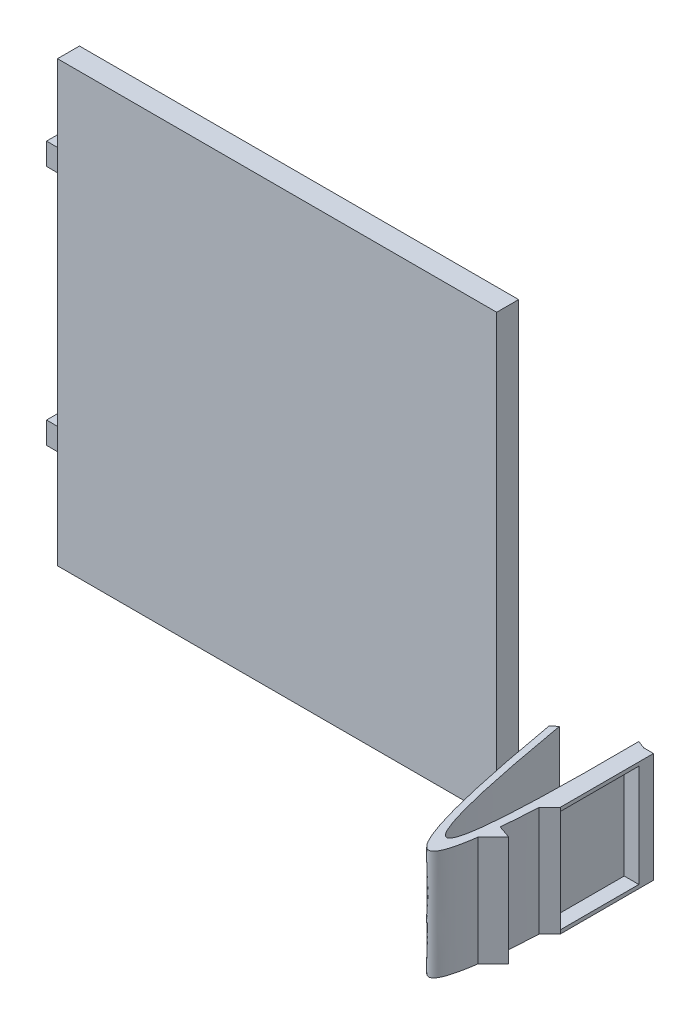
ISO-10303-21;
HEADER;
FILE_DESCRIPTION(('STEP AP214'),'2;1');
FILE_NAME('part.step','',(''),(''),'','','');
FILE_SCHEMA(('AUTOMOTIVE_DESIGN { 1 0 10303 214 1 1 1 1 }'));
ENDSEC;
DATA;
#1=APPLICATION_CONTEXT('core data for automotive mechanical design processes');
#2=APPLICATION_PROTOCOL_DEFINITION('international standard','automotive_design',2000,#1);
#3=PRODUCT_CONTEXT('',#1,'mechanical');
#4=PRODUCT('Part','Part','',(#3));
#5=PRODUCT_RELATED_PRODUCT_CATEGORY('part','',(#4));
#6=PRODUCT_DEFINITION_FORMATION('','',#4);
#7=PRODUCT_DEFINITION_CONTEXT('part definition',#1,'design');
#8=PRODUCT_DEFINITION('design','',#6,#7);
#9=PRODUCT_DEFINITION_SHAPE('','',#8);
#10=(LENGTH_UNIT() NAMED_UNIT(*) SI_UNIT(.MILLI.,.METRE.));
#11=(NAMED_UNIT(*) PLANE_ANGLE_UNIT() SI_UNIT($,.RADIAN.));
#12=(NAMED_UNIT(*) SI_UNIT($,.STERADIAN.) SOLID_ANGLE_UNIT());
#13=UNCERTAINTY_MEASURE_WITH_UNIT(LENGTH_MEASURE(1.E-05),#10,'distance_accuracy_value','');
#14=(GEOMETRIC_REPRESENTATION_CONTEXT(3) GLOBAL_UNCERTAINTY_ASSIGNED_CONTEXT((#13)) GLOBAL_UNIT_ASSIGNED_CONTEXT((#10,
#11,#12)) REPRESENTATION_CONTEXT('',''));
#15=CARTESIAN_POINT('',(0.,0.,0.));
#16=DIRECTION('',(0.,0.,1.));
#17=DIRECTION('',(1.,0.,0.));
#18=AXIS2_PLACEMENT_3D('',#15,#16,#17);
#19=CARTESIAN_POINT('',(-51.1962754260367,15.,5.77887922105447));
#20=CARTESIAN_POINT('',(-43.6159719352513,15.,49.1829599990755));
#21=CARTESIAN_POINT('',(-43.9884191852826,15.,2.12821551107821));
#22=B_SPLINE_CURVE_WITH_KNOTS('',2,(#19,#20,#21),.UNSPECIFIED.,.F.,.F.,(3,3),(0.,1.),.UNSPECIFIED.);
#23=DIRECTION('',(0.,-1.,0.));
#24=VECTOR('',#23,1.);
#25=SURFACE_OF_LINEAR_EXTRUSION('',#22,#24);
#26=CARTESIAN_POINT('',(-51.1962754260367,0.,5.77887922105447));
#27=CARTESIAN_POINT('',(-43.6159719352513,0.,49.1829599990755));
#28=CARTESIAN_POINT('',(-43.9884191852826,0.,2.12821551107821));
#29=B_SPLINE_CURVE_WITH_KNOTS('',2,(#26,#27,#28),.UNSPECIFIED.,.F.,.F.,(3,3),(0.,1.),.UNSPECIFIED.);
#30=CARTESIAN_POINT('',(-51.1962754260367,0.,5.77887922105447));
#31=VERTEX_POINT('',#30);
#32=CARTESIAN_POINT('',(-43.9884191852826,0.,2.12821551107823));
#33=VERTEX_POINT('',#32);
#34=EDGE_CURVE('E164',#31,#33,#29,.T.);
#35=ORIENTED_EDGE('',*,*,#34,.F.);
#36=DIRECTION('',(0.,-1.,0.));
#37=VECTOR('',#36,1.);
#38=CARTESIAN_POINT('',(-51.1962754260367,15.,5.77887922105447));
#39=LINE('',#38,#37);
#40=CARTESIAN_POINT('',(-51.1962754260367,15.,5.77887922105447));
#41=VERTEX_POINT('',#40);
#42=EDGE_CURVE('E12',#41,#31,#39,.T.);
#43=ORIENTED_EDGE('',*,*,#42,.F.);
#44=CARTESIAN_POINT('',(-43.9884191852826,15.,2.12821551107823));
#45=VERTEX_POINT('',#44);
#46=EDGE_CURVE('E196',#41,#45,#22,.T.);
#47=ORIENTED_EDGE('',*,*,#46,.T.);
#48=DIRECTION('',(0.,-1.,0.));
#49=VECTOR('',#48,1.);
#50=CARTESIAN_POINT('',(-43.9884191852826,15.,2.12821551107823));
#51=LINE('',#50,#49);
#52=EDGE_CURVE('E69',#45,#33,#51,.T.);
#53=ORIENTED_EDGE('',*,*,#52,.T.);
#54=EDGE_LOOP('',(#35,#43,#47,#53));
#55=FACE_BOUND('',#54,.T.);
#56=ADVANCED_FACE('F45',(#55),#25,.T.);
#57=CARTESIAN_POINT('',(-16.2333755961962,15.,-21.1087842015149));
#58=DIRECTION('',(-0.609612829217716,0.,-0.792699311500377));
#59=DIRECTION('',(-0.792699311500377,0.,0.609612829217716));
#60=AXIS2_PLACEMENT_3D('',#57,#58,#59);
#61=PLANE('',#60);
#62=DIRECTION('',(0.792699311500377,0.,-0.609612829217716));
#63=VECTOR('',#62,1.);
#64=CARTESIAN_POINT('',(-16.2333755961962,0.,-21.1087842015149));
#65=LINE('',#64,#63);
#66=CARTESIAN_POINT('',(-51.9660766051118,0.,6.37088260481278));
#67=VERTEX_POINT('',#66);
#68=EDGE_CURVE('E168',#67,#31,#65,.T.);
#69=ORIENTED_EDGE('',*,*,#68,.F.);
#70=DIRECTION('',(0.,-1.,0.));
#71=VECTOR('',#70,1.);
#72=CARTESIAN_POINT('',(-51.9660766051118,15.,6.37088260481278));
#73=LINE('',#72,#71);
#74=CARTESIAN_POINT('',(-51.9660766051118,15.,6.37088260481278));
#75=VERTEX_POINT('',#74);
#76=EDGE_CURVE('E53',#75,#67,#73,.T.);
#77=ORIENTED_EDGE('',*,*,#76,.F.);
#78=DIRECTION('',(0.792699311500377,0.,-0.609612829217716));
#79=VECTOR('',#78,1.);
#80=CARTESIAN_POINT('',(-16.2333755961962,15.,-21.1087842015149));
#81=LINE('',#80,#79);
#82=EDGE_CURVE('E227',#75,#41,#81,.T.);
#83=ORIENTED_EDGE('',*,*,#82,.T.);
#84=ORIENTED_EDGE('',*,*,#42,.T.);
#85=EDGE_LOOP('',(#69,#77,#83,#84));
#86=FACE_BOUND('',#85,.T.);
#87=ADVANCED_FACE('F226',(#86),#61,.T.);
#88=CARTESIAN_POINT('',(-51.9660766051118,15.,6.37088260481278));
#89=CARTESIAN_POINT('',(-43.9063655122837,15.,52.160925824761));
#90=CARTESIAN_POINT('',(-42.4311206277044,15.,17.9235905296126));
#91=CARTESIAN_POINT('',(-42.8930388904973,15.,2.5378638465412));
#92=B_SPLINE_CURVE_WITH_KNOTS('',3,(#88,#89,#90,#91),.UNSPECIFIED.,.F.,.F.,(4,4),(0.,1.),.UNSPECIFIED.);
#93=DIRECTION('',(0.,-1.,0.));
#94=VECTOR('',#93,1.);
#95=SURFACE_OF_LINEAR_EXTRUSION('',#92,#94);
#96=CARTESIAN_POINT('',(-51.9660766051118,0.,6.37088260481278));
#97=CARTESIAN_POINT('',(-43.9063655122837,0.,52.160925824761));
#98=CARTESIAN_POINT('',(-42.4311206277044,0.,17.9235905296126));
#99=CARTESIAN_POINT('',(-42.8930388904973,0.,2.5378638465412));
#100=B_SPLINE_CURVE_WITH_KNOTS('',3,(#96,#97,#98,#99),.UNSPECIFIED.,.F.,.F.,(4,4),(0.,1.),.UNSPECIFIED.);
#101=CARTESIAN_POINT('',(-43.6555720347852,0.,24.3988873492868));
#102=VERTEX_POINT('',#101);
#103=EDGE_CURVE('E175',#67,#102,#100,.T.);
#104=ORIENTED_EDGE('',*,*,#103,.T.);
#105=DIRECTION('',(0.,-1.,0.));
#106=VECTOR('',#105,1.);
#107=CARTESIAN_POINT('',(-43.6555720347852,15.,24.3988873492868));
#108=LINE('',#107,#106);
#109=CARTESIAN_POINT('',(-43.6555720347852,15.,24.3988873492868));
#110=VERTEX_POINT('',#109);
#111=EDGE_CURVE('E210',#110,#102,#108,.T.);
#112=ORIENTED_EDGE('',*,*,#111,.F.);
#113=EDGE_CURVE('E217',#75,#110,#92,.T.);
#114=ORIENTED_EDGE('',*,*,#113,.F.);
#115=ORIENTED_EDGE('',*,*,#76,.T.);
#116=EDGE_LOOP('',(#104,#112,#114,#115));
#117=FACE_BOUND('',#116,.T.);
#118=ADVANCED_FACE('F215',(#117),#95,.F.);
#119=CARTESIAN_POINT('',(-9.6283423427493,15.,-9.62834234274927));
#120=DIRECTION('',(-0.707106781186549,0.,-0.707106781186546));
#121=DIRECTION('',(-0.707106781186546,0.,0.707106781186549));
#122=AXIS2_PLACEMENT_3D('',#119,#120,#121);
#123=PLANE('',#122);
#124=DIRECTION('',(0.707106781186546,0.,-0.707106781186549));
#125=VECTOR('',#124,1.);
#126=CARTESIAN_POINT('',(-9.6283423427493,0.,-9.62834234274927));
#127=LINE('',#126,#125);
#128=CARTESIAN_POINT('',(-41.5703826815086,0.,22.3136979960101));
#129=VERTEX_POINT('',#128);
#130=EDGE_CURVE('E179',#102,#129,#127,.T.);
#131=ORIENTED_EDGE('',*,*,#130,.T.);
#132=DIRECTION('',(0.,-1.,0.));
#133=VECTOR('',#132,1.);
#134=CARTESIAN_POINT('',(-41.5703826815086,15.,22.3136979960101));
#135=LINE('',#134,#133);
#136=CARTESIAN_POINT('',(-41.5703826815086,15.,22.3136979960101));
#137=VERTEX_POINT('',#136);
#138=EDGE_CURVE('E207',#137,#129,#135,.T.);
#139=ORIENTED_EDGE('',*,*,#138,.F.);
#140=DIRECTION('',(0.707106781186546,0.,-0.707106781186549));
#141=VECTOR('',#140,1.);
#142=CARTESIAN_POINT('',(-9.6283423427493,15.,-9.62834234274927));
#143=LINE('',#142,#141);
#144=EDGE_CURVE('E248',#110,#137,#143,.T.);
#145=ORIENTED_EDGE('',*,*,#144,.F.);
#146=ORIENTED_EDGE('',*,*,#111,.T.);
#147=EDGE_LOOP('',(#131,#139,#145,#146));
#148=FACE_BOUND('',#147,.T.);
#149=ADVANCED_FACE('F247',(#148),#123,.F.);
#150=CARTESIAN_POINT('',(-11.293352944187,15.,32.753248292552));
#151=DIRECTION('',(-0.325968224772218,0.,0.945380725654405));
#152=DIRECTION('',(0.945380725654405,0.,0.325968224772218));
#153=AXIS2_PLACEMENT_3D('',#150,#151,#152);
#154=PLANE('',#153);
#155=DIRECTION('',(-0.945380725654405,0.,-0.325968224772218));
#156=VECTOR('',#155,1.);
#157=CARTESIAN_POINT('',(-11.293352944187,0.,32.753248292552));
#158=LINE('',#157,#156);
#159=CARTESIAN_POINT('',(-43.3481908012841,0.,21.7007079687507));
#160=VERTEX_POINT('',#159);
#161=EDGE_CURVE('E185',#129,#160,#158,.T.);
#162=ORIENTED_EDGE('',*,*,#161,.T.);
#163=DIRECTION('',(0.,-1.,0.));
#164=VECTOR('',#163,1.);
#165=CARTESIAN_POINT('',(-43.3481908012841,15.,21.7007079687507));
#166=LINE('',#165,#164);
#167=CARTESIAN_POINT('',(-43.3481908012841,15.,21.7007079687507));
#168=VERTEX_POINT('',#167);
#169=EDGE_CURVE('E204',#168,#160,#166,.T.);
#170=ORIENTED_EDGE('',*,*,#169,.F.);
#171=DIRECTION('',(-0.945380725654405,0.,-0.325968224772218));
#172=VECTOR('',#171,1.);
#173=CARTESIAN_POINT('',(-11.293352944187,15.,32.753248292552));
#174=LINE('',#173,#172);
#175=EDGE_CURVE('E243',#137,#168,#174,.T.);
#176=ORIENTED_EDGE('',*,*,#175,.F.);
#177=ORIENTED_EDGE('',*,*,#138,.T.);
#178=EDGE_LOOP('',(#162,#170,#176,#177));
#179=FACE_BOUND('',#178,.T.);
#180=ADVANCED_FACE('F242',(#179),#154,.F.);
#181=CARTESIAN_POINT('',(-43.011516668746,0.,16.7145404644495));
#182=VERTEX_POINT('',#181);
#183=EDGE_CURVE('E180',#160,#182,#100,.T.);
#184=ORIENTED_EDGE('',*,*,#183,.T.);
#185=DIRECTION('',(0.,-1.,0.));
#186=VECTOR('',#185,1.);
#187=CARTESIAN_POINT('',(-43.011516668746,15.,16.7145404644495));
#188=LINE('',#187,#186);
#189=CARTESIAN_POINT('',(-43.011516668746,15.,16.7145404644495));
#190=VERTEX_POINT('',#189);
#191=EDGE_CURVE('E201',#190,#182,#188,.T.);
#192=ORIENTED_EDGE('',*,*,#191,.F.);
#193=EDGE_CURVE('E238',#168,#190,#92,.T.);
#194=ORIENTED_EDGE('',*,*,#193,.F.);
#195=ORIENTED_EDGE('',*,*,#169,.T.);
#196=EDGE_LOOP('',(#184,#192,#194,#195));
#197=FACE_BOUND('',#196,.T.);
#198=ADVANCED_FACE('F237',(#197),#95,.F.);
#199=CARTESIAN_POINT('',(-13.1484881021466,15.,-13.1484881021466));
#200=DIRECTION('',(-0.707106781186549,0.,-0.707106781186546));
#201=DIRECTION('',(-0.707106781186546,0.,0.707106781186549));
#202=AXIS2_PLACEMENT_3D('',#199,#200,#201);
#203=PLANE('',#202);
#204=DIRECTION('',(0.707106781186546,0.,-0.707106781186549));
#205=VECTOR('',#204,1.);
#206=CARTESIAN_POINT('',(-13.1484881021466,0.,-13.1484881021466));
#207=LINE('',#206,#205);
#208=CARTESIAN_POINT('',(-41.5703826815086,0.,15.2734064772156));
#209=VERTEX_POINT('',#208);
#210=EDGE_CURVE('E187',#182,#209,#207,.T.);
#211=ORIENTED_EDGE('',*,*,#210,.T.);
#212=DIRECTION('',(0.,-1.,0.));
#213=VECTOR('',#212,1.);
#214=CARTESIAN_POINT('',(-41.5703826815086,15.,15.2734064772156));
#215=LINE('',#214,#213);
#216=CARTESIAN_POINT('',(-41.5703826815086,0.5,15.2734064772156));
#217=VERTEX_POINT('',#216);
#218=EDGE_CURVE('E155',#217,#209,#215,.T.);
#219=ORIENTED_EDGE('',*,*,#218,.F.);
#220=DIRECTION('',(0.,-1.,0.));
#221=VECTOR('',#220,1.);
#222=CARTESIAN_POINT('',(-41.5703826815086,0.5,15.2734064772156));
#223=LINE('',#222,#221);
#224=CARTESIAN_POINT('',(-41.5703826815086,14.5,15.2734064772156));
#225=VERTEX_POINT('',#224);
#226=EDGE_CURVE('E60',#225,#217,#223,.T.);
#227=ORIENTED_EDGE('',*,*,#226,.F.);
#228=CARTESIAN_POINT('',(-41.5703826815086,15.,15.2734064772156));
#229=VERTEX_POINT('',#228);
#230=EDGE_CURVE('E199',#229,#225,#215,.T.);
#231=ORIENTED_EDGE('',*,*,#230,.F.);
#232=DIRECTION('',(0.707106781186546,0.,-0.707106781186549));
#233=VECTOR('',#232,1.);
#234=CARTESIAN_POINT('',(-13.1484881021466,15.,-13.1484881021466));
#235=LINE('',#234,#233);
#236=EDGE_CURVE('E142',#190,#229,#235,.T.);
#237=ORIENTED_EDGE('',*,*,#236,.F.);
#238=ORIENTED_EDGE('',*,*,#191,.T.);
#239=EDGE_LOOP('',(#211,#219,#227,#231,#237,#238));
#240=FACE_BOUND('',#239,.T.);
#241=ADVANCED_FACE('F233',(#240),#203,.F.);
#242=CARTESIAN_POINT('',(-41.5703826815086,15.,0.));
#243=DIRECTION('',(-1.,0.,0.));
#244=DIRECTION('',(0.,0.,1.));
#245=AXIS2_PLACEMENT_3D('',#242,#243,#244);
#246=PLANE('',#245);
#247=ORIENTED_EDGE('',*,*,#230,.T.);
#248=DIRECTION('',(0.,0.,1.));
#249=VECTOR('',#248,1.);
#250=CARTESIAN_POINT('',(-41.5703826815086,14.5,15.2734064772156));
#251=LINE('',#250,#249);
#252=CARTESIAN_POINT('',(-41.5703826815086,14.5,4.5378638465412));
#253=VERTEX_POINT('',#252);
#254=EDGE_CURVE('E419',#253,#225,#251,.T.);
#255=ORIENTED_EDGE('',*,*,#254,.F.);
#256=DIRECTION('',(0.,1.,0.));
#257=VECTOR('',#256,1.);
#258=CARTESIAN_POINT('',(-41.5703826815086,0.5,4.5378638465412));
#259=LINE('',#258,#257);
#260=CARTESIAN_POINT('',(-41.5703826815086,0.5,4.5378638465412));
#261=VERTEX_POINT('',#260);
#262=EDGE_CURVE('E424',#261,#253,#259,.T.);
#263=ORIENTED_EDGE('',*,*,#262,.F.);
#264=DIRECTION('',(0.,0.,-1.));
#265=VECTOR('',#264,1.);
#266=CARTESIAN_POINT('',(-41.5703826815086,0.5,15.2734064772156));
#267=LINE('',#266,#265);
#268=EDGE_CURVE('E431',#217,#261,#267,.T.);
#269=ORIENTED_EDGE('',*,*,#268,.F.);
#270=ORIENTED_EDGE('',*,*,#218,.T.);
#271=DIRECTION('',(0.,0.,-1.));
#272=VECTOR('',#271,1.);
#273=CARTESIAN_POINT('',(-41.5703826815086,0.,0.));
#274=LINE('',#273,#272);
#275=CARTESIAN_POINT('',(-41.5703826815086,0.,2.5378638465412));
#276=VERTEX_POINT('',#275);
#277=EDGE_CURVE('E151',#209,#276,#274,.T.);
#278=ORIENTED_EDGE('',*,*,#277,.T.);
#279=DIRECTION('',(0.,-1.,0.));
#280=VECTOR('',#279,1.);
#281=CARTESIAN_POINT('',(-41.5703826815086,15.,2.5378638465412));
#282=LINE('',#281,#280);
#283=CARTESIAN_POINT('',(-41.5703826815086,15.,2.5378638465412));
#284=VERTEX_POINT('',#283);
#285=EDGE_CURVE('E148',#284,#276,#282,.T.);
#286=ORIENTED_EDGE('',*,*,#285,.F.);
#287=DIRECTION('',(0.,0.,-1.));
#288=VECTOR('',#287,1.);
#289=CARTESIAN_POINT('',(-41.5703826815086,15.,0.));
#290=LINE('',#289,#288);
#291=EDGE_CURVE('E134',#229,#284,#290,.T.);
#292=ORIENTED_EDGE('',*,*,#291,.F.);
#293=EDGE_LOOP('',(#247,#255,#263,#269,#270,#278,#286,#292));
#294=FACE_BOUND('',#293,.T.);
#295=ADVANCED_FACE('F149',(#294),#246,.F.);
#296=CARTESIAN_POINT('',(0.,15.,2.5378638465412));
#297=DIRECTION('',(0.,0.,1.));
#298=DIRECTION('',(1.,0.,0.));
#299=AXIS2_PLACEMENT_3D('',#296,#297,#298);
#300=PLANE('',#299);
#301=DIRECTION('',(-1.,0.,0.));
#302=VECTOR('',#301,1.);
#303=CARTESIAN_POINT('',(0.,0.,2.5378638465412));
#304=LINE('',#303,#302);
#305=CARTESIAN_POINT('',(-42.8930388904973,0.,2.5378638465412));
#306=VERTEX_POINT('',#305);
#307=EDGE_CURVE('E191',#276,#306,#304,.T.);
#308=ORIENTED_EDGE('',*,*,#307,.T.);
#309=DIRECTION('',(0.,-1.,0.));
#310=VECTOR('',#309,1.);
#311=CARTESIAN_POINT('',(-42.8930388904973,15.,2.5378638465412));
#312=LINE('',#311,#310);
#313=CARTESIAN_POINT('',(-42.8930388904973,15.,2.5378638465412));
#314=VERTEX_POINT('',#313);
#315=EDGE_CURVE('E156',#314,#306,#312,.T.);
#316=ORIENTED_EDGE('',*,*,#315,.F.);
#317=DIRECTION('',(-1.,0.,0.));
#318=VECTOR('',#317,1.);
#319=CARTESIAN_POINT('',(0.,15.,2.5378638465412));
#320=LINE('',#319,#318);
#321=EDGE_CURVE('E139',#284,#314,#320,.T.);
#322=ORIENTED_EDGE('',*,*,#321,.F.);
#323=ORIENTED_EDGE('',*,*,#285,.T.);
#324=EDGE_LOOP('',(#308,#316,#322,#323));
#325=FACE_BOUND('',#324,.T.);
#326=ADVANCED_FACE('F158',(#325),#300,.F.);
#327=CARTESIAN_POINT('',(-6.09558585254277,15.,16.2993085776881));
#328=DIRECTION('',(0.350284220680538,0.,-0.936643456573646));
#329=DIRECTION('',(-0.936643456573647,0.,-0.350284220680538));
#330=AXIS2_PLACEMENT_3D('',#327,#328,#329);
#331=PLANE('',#330);
#332=DIRECTION('',(0.936643456573646,0.,0.350284220680538));
#333=VECTOR('',#332,1.);
#334=CARTESIAN_POINT('',(-6.09558585254277,0.,16.2993085776881));
#335=LINE('',#334,#333);
#336=EDGE_CURVE('E193',#33,#306,#335,.T.);
#337=ORIENTED_EDGE('',*,*,#336,.F.);
#338=ORIENTED_EDGE('',*,*,#52,.F.);
#339=DIRECTION('',(0.936643456573646,0.,0.350284220680538));
#340=VECTOR('',#339,1.);
#341=CARTESIAN_POINT('',(-6.09558585254277,15.,16.2993085776881));
#342=LINE('',#341,#340);
#343=EDGE_CURVE('E159',#45,#314,#342,.T.);
#344=ORIENTED_EDGE('',*,*,#343,.T.);
#345=ORIENTED_EDGE('',*,*,#315,.T.);
#346=EDGE_LOOP('',(#337,#338,#344,#345));
#347=FACE_BOUND('',#346,.T.);
#348=ADVANCED_FACE('F228',(#347),#331,.T.);
#349=CARTESIAN_POINT('',(0.,15.,0.));
#350=DIRECTION('',(0.,1.,0.));
#351=DIRECTION('',(0.,0.,1.));
#352=AXIS2_PLACEMENT_3D('',#349,#350,#351);
#353=PLANE('',#352);
#354=ORIENTED_EDGE('',*,*,#46,.F.);
#355=ORIENTED_EDGE('',*,*,#82,.F.);
#356=ORIENTED_EDGE('',*,*,#113,.T.);
#357=ORIENTED_EDGE('',*,*,#144,.T.);
#358=ORIENTED_EDGE('',*,*,#175,.T.);
#359=ORIENTED_EDGE('',*,*,#193,.T.);
#360=ORIENTED_EDGE('',*,*,#236,.T.);
#361=ORIENTED_EDGE('',*,*,#291,.T.);
#362=ORIENTED_EDGE('',*,*,#321,.T.);
#363=ORIENTED_EDGE('',*,*,#343,.F.);
#364=EDGE_LOOP('',(#354,#355,#356,#357,#358,#359,#360,#361,#362,#363));
#365=FACE_BOUND('',#364,.T.);
#366=ADVANCED_FACE('F136',(#365),#353,.T.);
#367=CARTESIAN_POINT('',(0.,0.,0.));
#368=DIRECTION('',(0.,1.,0.));
#369=DIRECTION('',(0.,0.,1.));
#370=AXIS2_PLACEMENT_3D('',#367,#368,#369);
#371=PLANE('',#370);
#372=ORIENTED_EDGE('',*,*,#34,.T.);
#373=ORIENTED_EDGE('',*,*,#336,.T.);
#374=ORIENTED_EDGE('',*,*,#307,.F.);
#375=ORIENTED_EDGE('',*,*,#277,.F.);
#376=ORIENTED_EDGE('',*,*,#210,.F.);
#377=ORIENTED_EDGE('',*,*,#183,.F.);
#378=ORIENTED_EDGE('',*,*,#161,.F.);
#379=ORIENTED_EDGE('',*,*,#130,.F.);
#380=ORIENTED_EDGE('',*,*,#103,.F.);
#381=ORIENTED_EDGE('',*,*,#68,.T.);
#382=EDGE_LOOP('',(#372,#373,#374,#375,#376,#377,#378,#379,#380,#381));
#383=FACE_BOUND('',#382,.T.);
#384=ADVANCED_FACE('F224',(#383),#371,.F.);
#385=CARTESIAN_POINT('',(-43.5703826815086,0.5,15.2734064772156));
#386=DIRECTION('',(0.,0.,1.));
#387=DIRECTION('',(1.,0.,0.));
#388=AXIS2_PLACEMENT_3D('',#385,#386,#387);
#389=PLANE('',#388);
#390=ORIENTED_EDGE('',*,*,#226,.T.);
#391=DIRECTION('',(1.,0.,0.));
#392=VECTOR('',#391,1.);
#393=CARTESIAN_POINT('',(-43.5703826815086,0.5,15.2734064772156));
#394=LINE('',#393,#392);
#395=CARTESIAN_POINT('',(-43.5703826815086,0.5,15.2734064772156));
#396=VERTEX_POINT('',#395);
#397=EDGE_CURVE('E429',#396,#217,#394,.T.);
#398=ORIENTED_EDGE('',*,*,#397,.F.);
#399=DIRECTION('',(0.,-1.,0.));
#400=VECTOR('',#399,1.);
#401=CARTESIAN_POINT('',(-43.5703826815086,0.5,15.2734064772156));
#402=LINE('',#401,#400);
#403=CARTESIAN_POINT('',(-43.5703826815086,14.5,15.2734064772156));
#404=VERTEX_POINT('',#403);
#405=EDGE_CURVE('E411',#404,#396,#402,.T.);
#406=ORIENTED_EDGE('',*,*,#405,.F.);
#407=DIRECTION('',(1.,0.,0.));
#408=VECTOR('',#407,1.);
#409=CARTESIAN_POINT('',(-43.5703826815086,14.5,15.2734064772156));
#410=LINE('',#409,#408);
#411=EDGE_CURVE('E169',#404,#225,#410,.T.);
#412=ORIENTED_EDGE('',*,*,#411,.T.);
#413=EDGE_LOOP('',(#390,#398,#406,#412));
#414=FACE_BOUND('',#413,.T.);
#415=ADVANCED_FACE('F343',(#414),#389,.F.);
#416=CARTESIAN_POINT('',(-43.5703826815086,14.5,15.2734064772156));
#417=DIRECTION('',(0.,1.,0.));
#418=DIRECTION('',(0.,0.,1.));
#419=AXIS2_PLACEMENT_3D('',#416,#417,#418);
#420=PLANE('',#419);
#421=ORIENTED_EDGE('',*,*,#254,.T.);
#422=ORIENTED_EDGE('',*,*,#411,.F.);
#423=DIRECTION('',(0.,0.,1.));
#424=VECTOR('',#423,1.);
#425=CARTESIAN_POINT('',(-43.5703826815086,14.5,15.2734064772156));
#426=LINE('',#425,#424);
#427=CARTESIAN_POINT('',(-43.5703826815086,14.5,4.5378638465412));
#428=VERTEX_POINT('',#427);
#429=EDGE_CURVE('E417',#428,#404,#426,.T.);
#430=ORIENTED_EDGE('',*,*,#429,.F.);
#431=DIRECTION('',(1.,0.,0.));
#432=VECTOR('',#431,1.);
#433=CARTESIAN_POINT('',(-43.5703826815086,14.5,4.5378638465412));
#434=LINE('',#433,#432);
#435=EDGE_CURVE('E437',#428,#253,#434,.T.);
#436=ORIENTED_EDGE('',*,*,#435,.T.);
#437=EDGE_LOOP('',(#421,#422,#430,#436));
#438=FACE_BOUND('',#437,.T.);
#439=ADVANCED_FACE('F363',(#438),#420,.F.);
#440=CARTESIAN_POINT('',(-43.5703826815086,0.5,4.5378638465412));
#441=DIRECTION('',(0.,0.,-1.));
#442=DIRECTION('',(-1.,0.,0.));
#443=AXIS2_PLACEMENT_3D('',#440,#441,#442);
#444=PLANE('',#443);
#445=ORIENTED_EDGE('',*,*,#262,.T.);
#446=ORIENTED_EDGE('',*,*,#435,.F.);
#447=DIRECTION('',(0.,1.,0.));
#448=VECTOR('',#447,1.);
#449=CARTESIAN_POINT('',(-43.5703826815086,0.5,4.5378638465412));
#450=LINE('',#449,#448);
#451=CARTESIAN_POINT('',(-43.5703826815086,0.5,4.5378638465412));
#452=VERTEX_POINT('',#451);
#453=EDGE_CURVE('E421',#452,#428,#450,.T.);
#454=ORIENTED_EDGE('',*,*,#453,.F.);
#455=DIRECTION('',(1.,0.,0.));
#456=VECTOR('',#455,1.);
#457=CARTESIAN_POINT('',(-43.5703826815086,0.5,4.5378638465412));
#458=LINE('',#457,#456);
#459=EDGE_CURVE('E440',#452,#261,#458,.T.);
#460=ORIENTED_EDGE('',*,*,#459,.T.);
#461=EDGE_LOOP('',(#445,#446,#454,#460));
#462=FACE_BOUND('',#461,.T.);
#463=ADVANCED_FACE('F372',(#462),#444,.F.);
#464=CARTESIAN_POINT('',(-43.5703826815086,0.5,15.2734064772156));
#465=DIRECTION('',(0.,-1.,0.));
#466=DIRECTION('',(0.,0.,-1.));
#467=AXIS2_PLACEMENT_3D('',#464,#465,#466);
#468=PLANE('',#467);
#469=ORIENTED_EDGE('',*,*,#268,.T.);
#470=ORIENTED_EDGE('',*,*,#459,.F.);
#471=DIRECTION('',(0.,0.,-1.));
#472=VECTOR('',#471,1.);
#473=CARTESIAN_POINT('',(-43.5703826815086,0.5,15.2734064772156));
#474=LINE('',#473,#472);
#475=EDGE_CURVE('E415',#396,#452,#474,.T.);
#476=ORIENTED_EDGE('',*,*,#475,.F.);
#477=ORIENTED_EDGE('',*,*,#397,.T.);
#478=EDGE_LOOP('',(#469,#470,#476,#477));
#479=FACE_BOUND('',#478,.T.);
#480=ADVANCED_FACE('F382',(#479),#468,.F.);
#481=CARTESIAN_POINT('',(-43.5703826815086,0.,0.));
#482=DIRECTION('',(-1.,0.,0.));
#483=DIRECTION('',(0.,0.,1.));
#484=AXIS2_PLACEMENT_3D('',#481,#482,#483);
#485=PLANE('',#484);
#486=ORIENTED_EDGE('',*,*,#405,.T.);
#487=ORIENTED_EDGE('',*,*,#475,.T.);
#488=ORIENTED_EDGE('',*,*,#453,.T.);
#489=ORIENTED_EDGE('',*,*,#429,.T.);
#490=EDGE_LOOP('',(#486,#487,#488,#489));
#491=FACE_BOUND('',#490,.T.);
#492=ADVANCED_FACE('F392',(#491),#485,.F.);
#493=CLOSED_SHELL('',(#56,#87,#118,#149,#180,#198,#241,#295,#326,#348,#366,#384,#415,#439,#463,
#480,#492));
#494=MANIFOLD_SOLID_BREP('B2',#493);
#495=CARTESIAN_POINT('',(-122.529091576475,56.9529134690595,3.));
#496=DIRECTION('',(1.,0.,0.));
#497=DIRECTION('',(0.,1.,0.));
#498=AXIS2_PLACEMENT_3D('',#495,#496,#497);
#499=PLANE('',#498);
#500=DIRECTION('',(0.,0.,-1.));
#501=VECTOR('',#500,1.);
#502=CARTESIAN_POINT('',(-122.529091576475,11.9529134690595,1.5));
#503=LINE('',#502,#501);
#504=CARTESIAN_POINT('',(-122.529091576475,11.9529134690595,1.5));
#505=VERTEX_POINT('',#504);
#506=CARTESIAN_POINT('',(-122.529091576475,11.9529134690595,0.));
#507=VERTEX_POINT('',#506);
#508=EDGE_CURVE('E495',#505,#507,#503,.T.);
#509=ORIENTED_EDGE('',*,*,#508,.F.);
#510=DIRECTION('',(0.,1.,0.));
#511=VECTOR('',#510,1.);
#512=CARTESIAN_POINT('',(-122.529091576475,8.95291346905947,1.5));
#513=LINE('',#512,#511);
#514=CARTESIAN_POINT('',(-122.529091576475,8.95291346905946,1.5));
#515=VERTEX_POINT('',#514);
#516=EDGE_CURVE('E490',#515,#505,#513,.T.);
#517=ORIENTED_EDGE('',*,*,#516,.F.);
#518=DIRECTION('',(0.,0.,-1.));
#519=VECTOR('',#518,1.);
#520=CARTESIAN_POINT('',(-122.529091576475,8.95291346905947,1.5));
#521=LINE('',#520,#519);
#522=CARTESIAN_POINT('',(-122.529091576475,8.95291346905947,0.));
#523=VERTEX_POINT('',#522);
#524=EDGE_CURVE('E584',#515,#523,#521,.T.);
#525=ORIENTED_EDGE('',*,*,#524,.T.);
#526=DIRECTION('',(0.,-1.,0.));
#527=VECTOR('',#526,1.);
#528=CARTESIAN_POINT('',(-122.529091576475,56.9529134690595,0.));
#529=LINE('',#528,#527);
#530=CARTESIAN_POINT('',(-122.529091576475,-3.04708653094053,0.));
#531=VERTEX_POINT('',#530);
#532=EDGE_CURVE('E624',#523,#531,#529,.T.);
#533=ORIENTED_EDGE('',*,*,#532,.T.);
#534=DIRECTION('',(0.,0.,-1.));
#535=VECTOR('',#534,1.);
#536=CARTESIAN_POINT('',(-122.529091576475,-3.04708653094053,3.));
#537=LINE('',#536,#535);
#538=CARTESIAN_POINT('',(-122.529091576475,-3.04708653094053,3.));
#539=VERTEX_POINT('',#538);
#540=EDGE_CURVE('E43',#539,#531,#537,.T.);
#541=ORIENTED_EDGE('',*,*,#540,.F.);
#542=DIRECTION('',(0.,-1.,0.));
#543=VECTOR('',#542,1.);
#544=CARTESIAN_POINT('',(-122.529091576475,56.9529134690595,3.));
#545=LINE('',#544,#543);
#546=CARTESIAN_POINT('',(-122.529091576475,56.9529134690595,3.));
#547=VERTEX_POINT('',#546);
#548=EDGE_CURVE('E625',#547,#539,#545,.T.);
#549=ORIENTED_EDGE('',*,*,#548,.F.);
#550=DIRECTION('',(0.,0.,-1.));
#551=VECTOR('',#550,1.);
#552=CARTESIAN_POINT('',(-122.529091576475,56.9529134690595,3.));
#553=LINE('',#552,#551);
#554=CARTESIAN_POINT('',(-122.529091576475,56.9529134690595,0.));
#555=VERTEX_POINT('',#554);
#556=EDGE_CURVE('E635',#547,#555,#553,.T.);
#557=ORIENTED_EDGE('',*,*,#556,.T.);
#558=CARTESIAN_POINT('',(-122.529091576475,44.9529134690595,0.));
#559=VERTEX_POINT('',#558);
#560=EDGE_CURVE('E636',#555,#559,#529,.T.);
#561=ORIENTED_EDGE('',*,*,#560,.T.);
#562=DIRECTION('',(0.,0.,-1.));
#563=VECTOR('',#562,1.);
#564=CARTESIAN_POINT('',(-122.529091576475,44.9529134690595,1.5));
#565=LINE('',#564,#563);
#566=CARTESIAN_POINT('',(-122.529091576475,44.9529134690595,1.5));
#567=VERTEX_POINT('',#566);
#568=EDGE_CURVE('E621',#567,#559,#565,.T.);
#569=ORIENTED_EDGE('',*,*,#568,.F.);
#570=DIRECTION('',(0.,1.,0.));
#571=VECTOR('',#570,1.);
#572=CARTESIAN_POINT('',(-122.529091576475,41.9529134690595,1.5));
#573=LINE('',#572,#571);
#574=CARTESIAN_POINT('',(-122.529091576475,41.9529134690595,1.5));
#575=VERTEX_POINT('',#574);
#576=EDGE_CURVE('E598',#575,#567,#573,.T.);
#577=ORIENTED_EDGE('',*,*,#576,.F.);
#578=DIRECTION('',(0.,0.,-1.));
#579=VECTOR('',#578,1.);
#580=CARTESIAN_POINT('',(-122.529091576475,41.9529134690595,1.5));
#581=LINE('',#580,#579);
#582=CARTESIAN_POINT('',(-122.529091576475,41.9529134690595,0.));
#583=VERTEX_POINT('',#582);
#584=EDGE_CURVE('E608',#575,#583,#581,.T.);
#585=ORIENTED_EDGE('',*,*,#584,.T.);
#586=EDGE_CURVE('E640',#583,#507,#529,.T.);
#587=ORIENTED_EDGE('',*,*,#586,.T.);
#588=EDGE_LOOP('',(#509,#517,#525,#533,#541,#549,#557,#561,#569,#577,#585,#587));
#589=FACE_BOUND('',#588,.T.);
#590=ADVANCED_FACE('F476',(#589),#499,.F.);
#591=CARTESIAN_POINT('',(-122.529091576475,-3.04708653094053,3.));
#592=DIRECTION('',(0.,1.,0.));
#593=DIRECTION('',(0.,0.,1.));
#594=AXIS2_PLACEMENT_3D('',#591,#592,#593);
#595=PLANE('',#594);
#596=DIRECTION('',(1.,0.,0.));
#597=VECTOR('',#596,1.);
#598=CARTESIAN_POINT('',(-122.529091576475,-3.04708653094053,0.));
#599=LINE('',#598,#597);
#600=CARTESIAN_POINT('',(-62.5290915764753,-3.04708653094053,0.));
#601=VERTEX_POINT('',#600);
#602=EDGE_CURVE('E639',#531,#601,#599,.T.);
#603=ORIENTED_EDGE('',*,*,#602,.T.);
#604=DIRECTION('',(0.,0.,-1.));
#605=VECTOR('',#604,1.);
#606=CARTESIAN_POINT('',(-62.5290915764753,-3.04708653094053,3.));
#607=LINE('',#606,#605);
#608=CARTESIAN_POINT('',(-62.5290915764753,-3.04708653094053,3.));
#609=VERTEX_POINT('',#608);
#610=EDGE_CURVE('E483',#609,#601,#607,.T.);
#611=ORIENTED_EDGE('',*,*,#610,.F.);
#612=DIRECTION('',(1.,0.,0.));
#613=VECTOR('',#612,1.);
#614=CARTESIAN_POINT('',(-122.529091576475,-3.04708653094053,3.));
#615=LINE('',#614,#613);
#616=EDGE_CURVE('E628',#539,#609,#615,.T.);
#617=ORIENTED_EDGE('',*,*,#616,.F.);
#618=ORIENTED_EDGE('',*,*,#540,.T.);
#619=EDGE_LOOP('',(#603,#611,#617,#618));
#620=FACE_BOUND('',#619,.T.);
#621=ADVANCED_FACE('F671',(#620),#595,.F.);
#622=CARTESIAN_POINT('',(-62.5290915764753,56.9529134690595,3.));
#623=DIRECTION('',(-1.,0.,0.));
#624=DIRECTION('',(0.,-1.,0.));
#625=AXIS2_PLACEMENT_3D('',#622,#623,#624);
#626=PLANE('',#625);
#627=DIRECTION('',(0.,1.,0.));
#628=VECTOR('',#627,1.);
#629=CARTESIAN_POINT('',(-62.5290915764753,56.9529134690595,0.));
#630=LINE('',#629,#628);
#631=CARTESIAN_POINT('',(-62.5290915764753,56.9529134690595,0.));
#632=VERTEX_POINT('',#631);
#633=EDGE_CURVE('E642',#601,#632,#630,.T.);
#634=ORIENTED_EDGE('',*,*,#633,.T.);
#635=DIRECTION('',(0.,0.,-1.));
#636=VECTOR('',#635,1.);
#637=CARTESIAN_POINT('',(-62.5290915764753,56.9529134690595,3.));
#638=LINE('',#637,#636);
#639=CARTESIAN_POINT('',(-62.5290915764753,56.9529134690595,3.));
#640=VERTEX_POINT('',#639);
#641=EDGE_CURVE('E647',#640,#632,#638,.T.);
#642=ORIENTED_EDGE('',*,*,#641,.F.);
#643=DIRECTION('',(0.,1.,0.));
#644=VECTOR('',#643,1.);
#645=CARTESIAN_POINT('',(-62.5290915764753,56.9529134690595,3.));
#646=LINE('',#645,#644);
#647=EDGE_CURVE('E631',#609,#640,#646,.T.);
#648=ORIENTED_EDGE('',*,*,#647,.F.);
#649=ORIENTED_EDGE('',*,*,#610,.T.);
#650=EDGE_LOOP('',(#634,#642,#648,#649));
#651=FACE_BOUND('',#650,.T.);
#652=ADVANCED_FACE('F654',(#651),#626,.F.);
#653=CARTESIAN_POINT('',(-122.529091576475,56.9529134690595,3.));
#654=DIRECTION('',(0.,-1.,0.));
#655=DIRECTION('',(1.,0.,0.));
#656=AXIS2_PLACEMENT_3D('',#653,#654,#655);
#657=PLANE('',#656);
#658=DIRECTION('',(-1.,0.,0.));
#659=VECTOR('',#658,1.);
#660=CARTESIAN_POINT('',(-122.529091576475,56.9529134690595,0.));
#661=LINE('',#660,#659);
#662=EDGE_CURVE('E629',#632,#555,#661,.T.);
#663=ORIENTED_EDGE('',*,*,#662,.T.);
#664=ORIENTED_EDGE('',*,*,#556,.F.);
#665=DIRECTION('',(-1.,0.,0.));
#666=VECTOR('',#665,1.);
#667=CARTESIAN_POINT('',(-122.529091576475,56.9529134690595,3.));
#668=LINE('',#667,#666);
#669=EDGE_CURVE('E633',#640,#547,#668,.T.);
#670=ORIENTED_EDGE('',*,*,#669,.F.);
#671=ORIENTED_EDGE('',*,*,#641,.T.);
#672=EDGE_LOOP('',(#663,#664,#670,#671));
#673=FACE_BOUND('',#672,.T.);
#674=ADVANCED_FACE('F664',(#673),#657,.F.);
#675=CARTESIAN_POINT('',(0.,0.,3.));
#676=DIRECTION('',(0.,0.,1.));
#677=DIRECTION('',(1.,0.,0.));
#678=AXIS2_PLACEMENT_3D('',#675,#676,#677);
#679=PLANE('',#678);
#680=ORIENTED_EDGE('',*,*,#548,.T.);
#681=ORIENTED_EDGE('',*,*,#616,.T.);
#682=ORIENTED_EDGE('',*,*,#647,.T.);
#683=ORIENTED_EDGE('',*,*,#669,.T.);
#684=EDGE_LOOP('',(#680,#681,#682,#683));
#685=FACE_BOUND('',#684,.T.);
#686=ADVANCED_FACE('F670',(#685),#679,.T.);
#687=CARTESIAN_POINT('',(0.,0.,0.));
#688=DIRECTION('',(0.,0.,1.));
#689=DIRECTION('',(1.,0.,0.));
#690=AXIS2_PLACEMENT_3D('',#687,#688,#689);
#691=PLANE('',#690);
#692=ORIENTED_EDGE('',*,*,#560,.F.);
#693=ORIENTED_EDGE('',*,*,#662,.F.);
#694=ORIENTED_EDGE('',*,*,#633,.F.);
#695=ORIENTED_EDGE('',*,*,#602,.F.);
#696=ORIENTED_EDGE('',*,*,#532,.F.);
#697=DIRECTION('',(1.,0.,0.));
#698=VECTOR('',#697,1.);
#699=CARTESIAN_POINT('',(-122.529091576475,8.95291346905947,0.));
#700=LINE('',#699,#698);
#701=CARTESIAN_POINT('',(-125.529091576475,8.95291346905946,0.));
#702=VERTEX_POINT('',#701);
#703=EDGE_CURVE('E591',#702,#523,#700,.T.);
#704=ORIENTED_EDGE('',*,*,#703,.F.);
#705=DIRECTION('',(0.,-1.,0.));
#706=VECTOR('',#705,1.);
#707=CARTESIAN_POINT('',(-125.529091576475,8.95291346905946,0.));
#708=LINE('',#707,#706);
#709=CARTESIAN_POINT('',(-125.529091576475,11.9529134690595,0.));
#710=VERTEX_POINT('',#709);
#711=EDGE_CURVE('E589',#710,#702,#708,.T.);
#712=ORIENTED_EDGE('',*,*,#711,.F.);
#713=DIRECTION('',(-1.,0.,0.));
#714=VECTOR('',#713,1.);
#715=CARTESIAN_POINT('',(-122.529091576475,11.9529134690595,0.));
#716=LINE('',#715,#714);
#717=EDGE_CURVE('E574',#507,#710,#716,.T.);
#718=ORIENTED_EDGE('',*,*,#717,.F.);
#719=ORIENTED_EDGE('',*,*,#586,.F.);
#720=DIRECTION('',(1.,0.,0.));
#721=VECTOR('',#720,1.);
#722=CARTESIAN_POINT('',(-122.529091576475,41.9529134690595,0.));
#723=LINE('',#722,#721);
#724=CARTESIAN_POINT('',(-125.529091576475,41.9529134690595,0.));
#725=VERTEX_POINT('',#724);
#726=EDGE_CURVE('E602',#725,#583,#723,.T.);
#727=ORIENTED_EDGE('',*,*,#726,.F.);
#728=DIRECTION('',(0.,-1.,0.));
#729=VECTOR('',#728,1.);
#730=CARTESIAN_POINT('',(-125.529091576475,41.9529134690595,0.));
#731=LINE('',#730,#729);
#732=CARTESIAN_POINT('',(-125.529091576475,44.9529134690595,0.));
#733=VERTEX_POINT('',#732);
#734=EDGE_CURVE('E610',#733,#725,#731,.T.);
#735=ORIENTED_EDGE('',*,*,#734,.F.);
#736=DIRECTION('',(-1.,0.,0.));
#737=VECTOR('',#736,1.);
#738=CARTESIAN_POINT('',(-122.529091576475,44.9529134690595,0.));
#739=LINE('',#738,#737);
#740=EDGE_CURVE('E597',#559,#733,#739,.T.);
#741=ORIENTED_EDGE('',*,*,#740,.F.);
#742=EDGE_LOOP('',(#692,#693,#694,#695,#696,#704,#712,#718,#719,#727,#735,#741));
#743=FACE_BOUND('',#742,.T.);
#744=ADVANCED_FACE('F661',(#743),#691,.F.);
#745=CARTESIAN_POINT('',(-122.529091576475,44.9529134690595,1.5));
#746=DIRECTION('',(0.,-1.,0.));
#747=DIRECTION('',(1.,0.,0.));
#748=AXIS2_PLACEMENT_3D('',#745,#746,#747);
#749=PLANE('',#748);
#750=ORIENTED_EDGE('',*,*,#740,.T.);
#751=DIRECTION('',(0.,0.,-1.));
#752=VECTOR('',#751,1.);
#753=CARTESIAN_POINT('',(-125.529091576475,44.9529134690595,1.5));
#754=LINE('',#753,#752);
#755=CARTESIAN_POINT('',(-125.529091576475,44.9529134690595,1.5));
#756=VERTEX_POINT('',#755);
#757=EDGE_CURVE('E618',#756,#733,#754,.T.);
#758=ORIENTED_EDGE('',*,*,#757,.F.);
#759=DIRECTION('',(-1.,0.,0.));
#760=VECTOR('',#759,1.);
#761=CARTESIAN_POINT('',(-122.529091576475,44.9529134690595,1.5));
#762=LINE('',#761,#760);
#763=EDGE_CURVE('E601',#567,#756,#762,.T.);
#764=ORIENTED_EDGE('',*,*,#763,.F.);
#765=ORIENTED_EDGE('',*,*,#568,.T.);
#766=EDGE_LOOP('',(#750,#758,#764,#765));
#767=FACE_BOUND('',#766,.T.);
#768=ADVANCED_FACE('F683',(#767),#749,.F.);
#769=CARTESIAN_POINT('',(-125.529091576475,41.9529134690595,1.5));
#770=DIRECTION('',(1.,0.,0.));
#771=DIRECTION('',(0.,0.,-1.));
#772=AXIS2_PLACEMENT_3D('',#769,#770,#771);
#773=PLANE('',#772);
#774=ORIENTED_EDGE('',*,*,#734,.T.);
#775=DIRECTION('',(0.,0.,-1.));
#776=VECTOR('',#775,1.);
#777=CARTESIAN_POINT('',(-125.529091576475,41.9529134690595,1.5));
#778=LINE('',#777,#776);
#779=CARTESIAN_POINT('',(-125.529091576475,41.9529134690595,1.5));
#780=VERTEX_POINT('',#779);
#781=EDGE_CURVE('E615',#780,#725,#778,.T.);
#782=ORIENTED_EDGE('',*,*,#781,.F.);
#783=DIRECTION('',(0.,-1.,0.));
#784=VECTOR('',#783,1.);
#785=CARTESIAN_POINT('',(-125.529091576475,41.9529134690595,1.5));
#786=LINE('',#785,#784);
#787=EDGE_CURVE('E604',#756,#780,#786,.T.);
#788=ORIENTED_EDGE('',*,*,#787,.F.);
#789=ORIENTED_EDGE('',*,*,#757,.T.);
#790=EDGE_LOOP('',(#774,#782,#788,#789));
#791=FACE_BOUND('',#790,.T.);
#792=ADVANCED_FACE('F688',(#791),#773,.F.);
#793=CARTESIAN_POINT('',(-122.529091576475,41.9529134690595,1.5));
#794=DIRECTION('',(0.,1.,0.));
#795=DIRECTION('',(0.,0.,1.));
#796=AXIS2_PLACEMENT_3D('',#793,#794,#795);
#797=PLANE('',#796);
#798=ORIENTED_EDGE('',*,*,#726,.T.);
#799=ORIENTED_EDGE('',*,*,#584,.F.);
#800=DIRECTION('',(1.,0.,0.));
#801=VECTOR('',#800,1.);
#802=CARTESIAN_POINT('',(-122.529091576475,41.9529134690595,1.5));
#803=LINE('',#802,#801);
#804=EDGE_CURVE('E606',#780,#575,#803,.T.);
#805=ORIENTED_EDGE('',*,*,#804,.F.);
#806=ORIENTED_EDGE('',*,*,#781,.T.);
#807=EDGE_LOOP('',(#798,#799,#805,#806));
#808=FACE_BOUND('',#807,.T.);
#809=ADVANCED_FACE('F692',(#808),#797,.F.);
#810=CARTESIAN_POINT('',(0.,0.,1.5));
#811=DIRECTION('',(0.,0.,1.));
#812=DIRECTION('',(1.,0.,0.));
#813=AXIS2_PLACEMENT_3D('',#810,#811,#812);
#814=PLANE('',#813);
#815=ORIENTED_EDGE('',*,*,#576,.T.);
#816=ORIENTED_EDGE('',*,*,#763,.T.);
#817=ORIENTED_EDGE('',*,*,#787,.T.);
#818=ORIENTED_EDGE('',*,*,#804,.T.);
#819=EDGE_LOOP('',(#815,#816,#817,#818));
#820=FACE_BOUND('',#819,.T.);
#821=ADVANCED_FACE('F696',(#820),#814,.T.);
#822=CARTESIAN_POINT('',(-122.529091576475,11.9529134690595,1.5));
#823=DIRECTION('',(0.,-1.,0.));
#824=DIRECTION('',(0.,0.,-1.));
#825=AXIS2_PLACEMENT_3D('',#822,#823,#824);
#826=PLANE('',#825);
#827=ORIENTED_EDGE('',*,*,#717,.T.);
#828=DIRECTION('',(0.,0.,-1.));
#829=VECTOR('',#828,1.);
#830=CARTESIAN_POINT('',(-125.529091576475,11.9529134690595,1.5));
#831=LINE('',#830,#829);
#832=CARTESIAN_POINT('',(-125.529091576475,11.9529134690595,1.5));
#833=VERTEX_POINT('',#832);
#834=EDGE_CURVE('E571',#833,#710,#831,.T.);
#835=ORIENTED_EDGE('',*,*,#834,.F.);
#836=DIRECTION('',(-1.,0.,0.));
#837=VECTOR('',#836,1.);
#838=CARTESIAN_POINT('',(-122.529091576475,11.9529134690595,1.5));
#839=LINE('',#838,#837);
#840=EDGE_CURVE('E562',#505,#833,#839,.T.);
#841=ORIENTED_EDGE('',*,*,#840,.F.);
#842=ORIENTED_EDGE('',*,*,#508,.T.);
#843=EDGE_LOOP('',(#827,#835,#841,#842));
#844=FACE_BOUND('',#843,.T.);
#845=ADVANCED_FACE('F572',(#844),#826,.F.);
#846=CARTESIAN_POINT('',(-125.529091576475,8.95291346905946,1.5));
#847=DIRECTION('',(1.,0.,0.));
#848=DIRECTION('',(0.,0.,-1.));
#849=AXIS2_PLACEMENT_3D('',#846,#847,#848);
#850=PLANE('',#849);
#851=ORIENTED_EDGE('',*,*,#711,.T.);
#852=DIRECTION('',(0.,0.,-1.));
#853=VECTOR('',#852,1.);
#854=CARTESIAN_POINT('',(-125.529091576475,8.95291346905946,1.5));
#855=LINE('',#854,#853);
#856=CARTESIAN_POINT('',(-125.529091576475,8.95291346905946,1.5));
#857=VERTEX_POINT('',#856);
#858=EDGE_CURVE('E577',#857,#702,#855,.T.);
#859=ORIENTED_EDGE('',*,*,#858,.F.);
#860=DIRECTION('',(0.,-1.,0.));
#861=VECTOR('',#860,1.);
#862=CARTESIAN_POINT('',(-125.529091576475,8.95291346905946,1.5));
#863=LINE('',#862,#861);
#864=EDGE_CURVE('E566',#833,#857,#863,.T.);
#865=ORIENTED_EDGE('',*,*,#864,.F.);
#866=ORIENTED_EDGE('',*,*,#834,.T.);
#867=EDGE_LOOP('',(#851,#859,#865,#866));
#868=FACE_BOUND('',#867,.T.);
#869=ADVANCED_FACE('F579',(#868),#850,.F.);
#870=CARTESIAN_POINT('',(-122.529091576475,8.95291346905947,1.5));
#871=DIRECTION('',(0.,1.,0.));
#872=DIRECTION('',(-1.,0.,0.));
#873=AXIS2_PLACEMENT_3D('',#870,#871,#872);
#874=PLANE('',#873);
#875=ORIENTED_EDGE('',*,*,#703,.T.);
#876=ORIENTED_EDGE('',*,*,#524,.F.);
#877=DIRECTION('',(1.,0.,0.));
#878=VECTOR('',#877,1.);
#879=CARTESIAN_POINT('',(-122.529091576475,8.95291346905947,1.5));
#880=LINE('',#879,#878);
#881=EDGE_CURVE('E582',#857,#515,#880,.T.);
#882=ORIENTED_EDGE('',*,*,#881,.F.);
#883=ORIENTED_EDGE('',*,*,#858,.T.);
#884=EDGE_LOOP('',(#875,#876,#882,#883));
#885=FACE_BOUND('',#884,.T.);
#886=ADVANCED_FACE('F705',(#885),#874,.F.);
#887=CARTESIAN_POINT('',(0.,0.,1.5));
#888=DIRECTION('',(0.,0.,1.));
#889=DIRECTION('',(1.,0.,0.));
#890=AXIS2_PLACEMENT_3D('',#887,#888,#889);
#891=PLANE('',#890);
#892=ORIENTED_EDGE('',*,*,#516,.T.);
#893=ORIENTED_EDGE('',*,*,#840,.T.);
#894=ORIENTED_EDGE('',*,*,#864,.T.);
#895=ORIENTED_EDGE('',*,*,#881,.T.);
#896=EDGE_LOOP('',(#892,#893,#894,#895));
#897=FACE_BOUND('',#896,.T.);
#898=ADVANCED_FACE('F564',(#897),#891,.T.);
#899=CLOSED_SHELL('',(#590,#621,#652,#674,#686,#744,#768,#792,#809,#821,#845,#869,#886,#898));
#900=MANIFOLD_SOLID_BREP('B6',#899);
#901=ADVANCED_BREP_SHAPE_REPRESENTATION('',(#18,#494,#900),#14);
#902=SHAPE_DEFINITION_REPRESENTATION(#9,#901);
ENDSEC;
END-ISO-10303-21;
